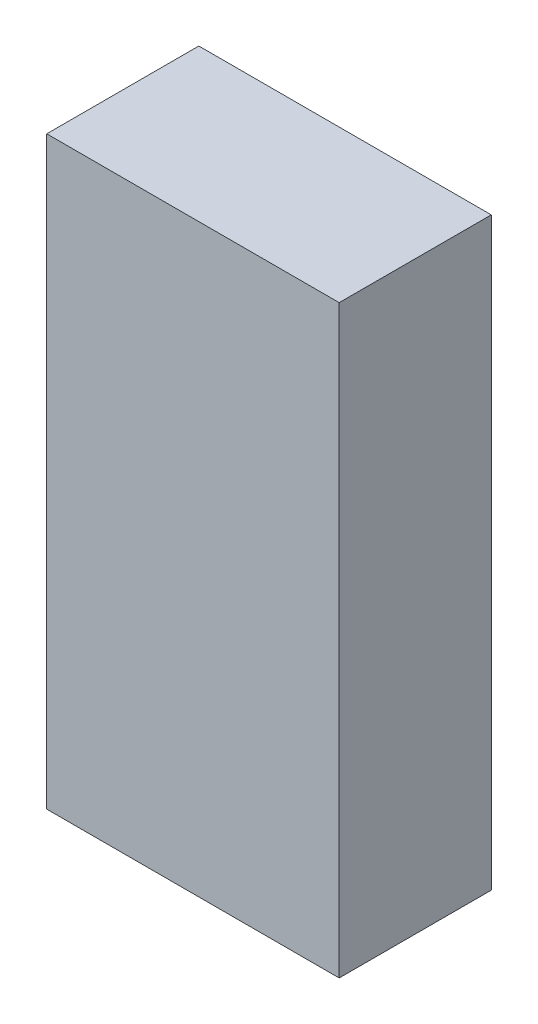
ISO-10303-21;
HEADER;
FILE_DESCRIPTION(('STEP AP214'),'2;1');
FILE_NAME('part.step','',(''),(''),'','','');
FILE_SCHEMA(('AUTOMOTIVE_DESIGN { 1 0 10303 214 1 1 1 1 }'));
ENDSEC;
DATA;
#1=APPLICATION_CONTEXT('core data for automotive mechanical design processes');
#2=APPLICATION_PROTOCOL_DEFINITION('international standard','automotive_design',2000,#1);
#3=PRODUCT_CONTEXT('',#1,'mechanical');
#4=PRODUCT('Part','Part','',(#3));
#5=PRODUCT_RELATED_PRODUCT_CATEGORY('part','',(#4));
#6=PRODUCT_DEFINITION_FORMATION('','',#4);
#7=PRODUCT_DEFINITION_CONTEXT('part definition',#1,'design');
#8=PRODUCT_DEFINITION('design','',#6,#7);
#9=PRODUCT_DEFINITION_SHAPE('','',#8);
#10=(LENGTH_UNIT() NAMED_UNIT(*) SI_UNIT(.MILLI.,.METRE.));
#11=(NAMED_UNIT(*) PLANE_ANGLE_UNIT() SI_UNIT($,.RADIAN.));
#12=(NAMED_UNIT(*) SI_UNIT($,.STERADIAN.) SOLID_ANGLE_UNIT());
#13=UNCERTAINTY_MEASURE_WITH_UNIT(LENGTH_MEASURE(1.E-05),#10,'distance_accuracy_value','');
#14=(GEOMETRIC_REPRESENTATION_CONTEXT(3) GLOBAL_UNCERTAINTY_ASSIGNED_CONTEXT((#13)) GLOBAL_UNIT_ASSIGNED_CONTEXT((#10,
#11,#12)) REPRESENTATION_CONTEXT('',''));
#15=CARTESIAN_POINT('',(0.,0.,0.));
#16=DIRECTION('',(0.,0.,1.));
#17=DIRECTION('',(1.,0.,0.));
#18=AXIS2_PLACEMENT_3D('',#15,#16,#17);
#19=CARTESIAN_POINT('',(-6.14374136688762,10.,-15.9573298063616));
#20=DIRECTION('',(-1.,0.,0.));
#21=DIRECTION('',(0.,0.,1.));
#22=AXIS2_PLACEMENT_3D('',#19,#20,#21);
#23=PLANE('',#22);
#24=DIRECTION('',(0.,0.,-1.));
#25=VECTOR('',#24,1.);
#26=CARTESIAN_POINT('',(-6.14374136688762,0.,-15.9573298063616));
#27=LINE('',#26,#25);
#28=CARTESIAN_POINT('',(-6.14374136688762,0.,-13.3573298063616));
#29=VERTEX_POINT('',#28);
#30=CARTESIAN_POINT('',(-6.14374136688762,0.,-15.9573298063616));
#31=VERTEX_POINT('',#30);
#32=EDGE_CURVE('E113',#29,#31,#27,.T.);
#33=ORIENTED_EDGE('',*,*,#32,.T.);
#34=DIRECTION('',(0.,-1.,0.));
#35=VECTOR('',#34,1.);
#36=CARTESIAN_POINT('',(-6.14374136688762,10.,-15.9573298063616));
#37=LINE('',#36,#35);
#38=CARTESIAN_POINT('',(-6.14374136688762,10.,-15.9573298063616));
#39=VERTEX_POINT('',#38);
#40=EDGE_CURVE('E11',#39,#31,#37,.T.);
#41=ORIENTED_EDGE('',*,*,#40,.F.);
#42=DIRECTION('',(0.,0.,-1.));
#43=VECTOR('',#42,1.);
#44=CARTESIAN_POINT('',(-6.14374136688762,10.,-15.9573298063616));
#45=LINE('',#44,#43);
#46=CARTESIAN_POINT('',(-6.14374136688762,10.,-13.3573298063616));
#47=VERTEX_POINT('',#46);
#48=EDGE_CURVE('E97',#47,#39,#45,.T.);
#49=ORIENTED_EDGE('',*,*,#48,.F.);
#50=DIRECTION('',(0.,-1.,0.));
#51=VECTOR('',#50,1.);
#52=CARTESIAN_POINT('',(-6.14374136688762,10.,-13.3573298063616));
#53=LINE('',#52,#51);
#54=EDGE_CURVE('E109',#47,#29,#53,.T.);
#55=ORIENTED_EDGE('',*,*,#54,.T.);
#56=EDGE_LOOP('',(#33,#41,#49,#55));
#57=FACE_BOUND('',#56,.T.);
#58=ADVANCED_FACE('F45',(#57),#23,.F.);
#59=CARTESIAN_POINT('',(-11.1437413668876,10.,-15.9573298063616));
#60=DIRECTION('',(0.,0.,1.));
#61=DIRECTION('',(1.,0.,0.));
#62=AXIS2_PLACEMENT_3D('',#59,#60,#61);
#63=PLANE('',#62);
#64=DIRECTION('',(-1.,0.,0.));
#65=VECTOR('',#64,1.);
#66=CARTESIAN_POINT('',(-11.1437413668876,0.,-15.9573298063616));
#67=LINE('',#66,#65);
#68=CARTESIAN_POINT('',(-11.1437413668876,0.,-15.9573298063616));
#69=VERTEX_POINT('',#68);
#70=EDGE_CURVE('E102',#31,#69,#67,.T.);
#71=ORIENTED_EDGE('',*,*,#70,.T.);
#72=DIRECTION('',(0.,-1.,0.));
#73=VECTOR('',#72,1.);
#74=CARTESIAN_POINT('',(-11.1437413668876,10.,-15.9573298063616));
#75=LINE('',#74,#73);
#76=CARTESIAN_POINT('',(-11.1437413668876,10.,-15.9573298063616));
#77=VERTEX_POINT('',#76);
#78=EDGE_CURVE('E54',#77,#69,#75,.T.);
#79=ORIENTED_EDGE('',*,*,#78,.F.);
#80=DIRECTION('',(-1.,0.,0.));
#81=VECTOR('',#80,1.);
#82=CARTESIAN_POINT('',(-11.1437413668876,10.,-15.9573298063616));
#83=LINE('',#82,#81);
#84=EDGE_CURVE('E92',#39,#77,#83,.T.);
#85=ORIENTED_EDGE('',*,*,#84,.F.);
#86=ORIENTED_EDGE('',*,*,#40,.T.);
#87=EDGE_LOOP('',(#71,#79,#85,#86));
#88=FACE_BOUND('',#87,.T.);
#89=ADVANCED_FACE('F101',(#88),#63,.F.);
#90=CARTESIAN_POINT('',(-11.1437413668876,10.,-15.9573298063616));
#91=DIRECTION('',(1.,0.,0.));
#92=DIRECTION('',(0.,0.,-1.));
#93=AXIS2_PLACEMENT_3D('',#90,#91,#92);
#94=PLANE('',#93);
#95=DIRECTION('',(0.,0.,1.));
#96=VECTOR('',#95,1.);
#97=CARTESIAN_POINT('',(-11.1437413668876,0.,-15.9573298063616));
#98=LINE('',#97,#96);
#99=CARTESIAN_POINT('',(-11.1437413668876,0.,-13.3573298063616));
#100=VERTEX_POINT('',#99);
#101=EDGE_CURVE('E79',#69,#100,#98,.T.);
#102=ORIENTED_EDGE('',*,*,#101,.T.);
#103=DIRECTION('',(0.,-1.,0.));
#104=VECTOR('',#103,1.);
#105=CARTESIAN_POINT('',(-11.1437413668876,10.,-13.3573298063616));
#106=LINE('',#105,#104);
#107=CARTESIAN_POINT('',(-11.1437413668876,10.,-13.3573298063616));
#108=VERTEX_POINT('',#107);
#109=EDGE_CURVE('E104',#108,#100,#106,.T.);
#110=ORIENTED_EDGE('',*,*,#109,.F.);
#111=DIRECTION('',(0.,0.,1.));
#112=VECTOR('',#111,1.);
#113=CARTESIAN_POINT('',(-11.1437413668876,10.,-15.9573298063616));
#114=LINE('',#113,#112);
#115=EDGE_CURVE('E95',#77,#108,#114,.T.);
#116=ORIENTED_EDGE('',*,*,#115,.F.);
#117=ORIENTED_EDGE('',*,*,#78,.T.);
#118=EDGE_LOOP('',(#102,#110,#116,#117));
#119=FACE_BOUND('',#118,.T.);
#120=ADVANCED_FACE('F105',(#119),#94,.F.);
#121=CARTESIAN_POINT('',(-11.1437413668876,10.,-13.3573298063616));
#122=DIRECTION('',(0.,0.,-1.));
#123=DIRECTION('',(-1.,0.,0.));
#124=AXIS2_PLACEMENT_3D('',#121,#122,#123);
#125=PLANE('',#124);
#126=DIRECTION('',(1.,0.,0.));
#127=VECTOR('',#126,1.);
#128=CARTESIAN_POINT('',(-11.1437413668876,0.,-13.3573298063616));
#129=LINE('',#128,#127);
#130=EDGE_CURVE('E85',#100,#29,#129,.T.);
#131=ORIENTED_EDGE('',*,*,#130,.T.);
#132=ORIENTED_EDGE('',*,*,#54,.F.);
#133=DIRECTION('',(1.,0.,0.));
#134=VECTOR('',#133,1.);
#135=CARTESIAN_POINT('',(-11.1437413668876,10.,-13.3573298063616));
#136=LINE('',#135,#134);
#137=EDGE_CURVE('E62',#108,#47,#136,.T.);
#138=ORIENTED_EDGE('',*,*,#137,.F.);
#139=ORIENTED_EDGE('',*,*,#109,.T.);
#140=EDGE_LOOP('',(#131,#132,#138,#139));
#141=FACE_BOUND('',#140,.T.);
#142=ADVANCED_FACE('F126',(#141),#125,.F.);
#143=CARTESIAN_POINT('',(0.,10.,0.));
#144=DIRECTION('',(0.,1.,0.));
#145=DIRECTION('',(0.,0.,1.));
#146=AXIS2_PLACEMENT_3D('',#143,#144,#145);
#147=PLANE('',#146);
#148=ORIENTED_EDGE('',*,*,#48,.T.);
#149=ORIENTED_EDGE('',*,*,#84,.T.);
#150=ORIENTED_EDGE('',*,*,#115,.T.);
#151=ORIENTED_EDGE('',*,*,#137,.T.);
#152=EDGE_LOOP('',(#148,#149,#150,#151));
#153=FACE_BOUND('',#152,.T.);
#154=ADVANCED_FACE('F93',(#153),#147,.T.);
#155=CARTESIAN_POINT('',(0.,0.,0.));
#156=DIRECTION('',(0.,1.,0.));
#157=DIRECTION('',(0.,0.,1.));
#158=AXIS2_PLACEMENT_3D('',#155,#156,#157);
#159=PLANE('',#158);
#160=ORIENTED_EDGE('',*,*,#32,.F.);
#161=ORIENTED_EDGE('',*,*,#130,.F.);
#162=ORIENTED_EDGE('',*,*,#101,.F.);
#163=ORIENTED_EDGE('',*,*,#70,.F.);
#164=EDGE_LOOP('',(#160,#161,#162,#163));
#165=FACE_BOUND('',#164,.T.);
#166=ADVANCED_FACE('F129',(#165),#159,.F.);
#167=CLOSED_SHELL('',(#58,#89,#120,#142,#154,#166));
#168=MANIFOLD_SOLID_BREP('B2',#167);
#169=ADVANCED_BREP_SHAPE_REPRESENTATION('',(#18,#168),#14);
#170=SHAPE_DEFINITION_REPRESENTATION(#9,#169);
ENDSEC;
END-ISO-10303-21;
